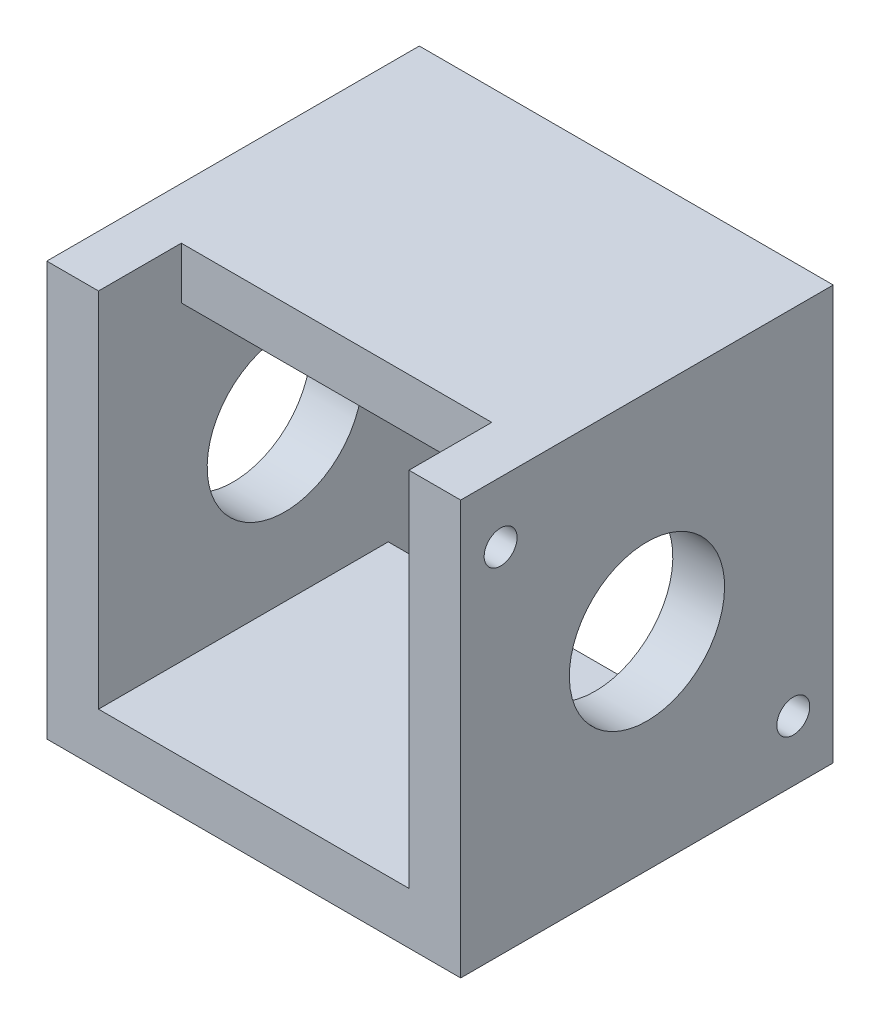
ISO-10303-21;
HEADER;
FILE_DESCRIPTION(('STEP AP214'),'2;1');
FILE_NAME('part.step','',(''),(''),'','','');
FILE_SCHEMA(('AUTOMOTIVE_DESIGN { 1 0 10303 214 1 1 1 1 }'));
ENDSEC;
DATA;
#1=APPLICATION_CONTEXT('core data for automotive mechanical design processes');
#2=APPLICATION_PROTOCOL_DEFINITION('international standard','automotive_design',2000,#1);
#3=PRODUCT_CONTEXT('',#1,'mechanical');
#4=PRODUCT('Part','Part','',(#3));
#5=PRODUCT_RELATED_PRODUCT_CATEGORY('part','',(#4));
#6=PRODUCT_DEFINITION_FORMATION('','',#4);
#7=PRODUCT_DEFINITION_CONTEXT('part definition',#1,'design');
#8=PRODUCT_DEFINITION('design','',#6,#7);
#9=PRODUCT_DEFINITION_SHAPE('','',#8);
#10=(LENGTH_UNIT() NAMED_UNIT(*) SI_UNIT(.MILLI.,.METRE.));
#11=(NAMED_UNIT(*) PLANE_ANGLE_UNIT() SI_UNIT($,.RADIAN.));
#12=(NAMED_UNIT(*) SI_UNIT($,.STERADIAN.) SOLID_ANGLE_UNIT());
#13=UNCERTAINTY_MEASURE_WITH_UNIT(LENGTH_MEASURE(1.E-05),#10,'distance_accuracy_value','');
#14=(GEOMETRIC_REPRESENTATION_CONTEXT(3) GLOBAL_UNCERTAINTY_ASSIGNED_CONTEXT((#13)) GLOBAL_UNIT_ASSIGNED_CONTEXT((#10,
#11,#12)) REPRESENTATION_CONTEXT('',''));
#15=CARTESIAN_POINT('',(0.,0.,0.));
#16=DIRECTION('',(0.,0.,1.));
#17=DIRECTION('',(1.,0.,0.));
#18=AXIS2_PLACEMENT_3D('',#15,#16,#17);
#19=CARTESIAN_POINT('',(0.,0.,45.72));
#20=DIRECTION('',(0.,0.,1.));
#21=DIRECTION('',(1.,0.,0.));
#22=AXIS2_PLACEMENT_3D('',#19,#20,#21);
#23=PLANE('',#22);
#24=DIRECTION('',(-1.,0.,0.));
#25=VECTOR('',#24,1.);
#26=CARTESIAN_POINT('',(-25.4,25.4,45.72));
#27=LINE('',#26,#25);
#28=CARTESIAN_POINT('',(25.4,25.4,45.72));
#29=VERTEX_POINT('',#28);
#30=CARTESIAN_POINT('',(19.05,25.4,45.72));
#31=VERTEX_POINT('',#30);
#32=EDGE_CURVE('E121',#29,#31,#27,.T.);
#33=ORIENTED_EDGE('',*,*,#32,.T.);
#34=DIRECTION('',(0.,1.,0.));
#35=VECTOR('',#34,1.);
#36=CARTESIAN_POINT('',(19.05,25.4,45.72));
#37=LINE('',#36,#35);
#38=CARTESIAN_POINT('',(19.05,-19.05,45.72));
#39=VERTEX_POINT('',#38);
#40=EDGE_CURVE('E169',#39,#31,#37,.T.);
#41=ORIENTED_EDGE('',*,*,#40,.F.);
#42=DIRECTION('',(1.,0.,0.));
#43=VECTOR('',#42,1.);
#44=CARTESIAN_POINT('',(-25.4,-19.05,45.72));
#45=LINE('',#44,#43);
#46=CARTESIAN_POINT('',(-19.05,-19.05,45.72));
#47=VERTEX_POINT('',#46);
#48=EDGE_CURVE('E258',#47,#39,#45,.T.);
#49=ORIENTED_EDGE('',*,*,#48,.F.);
#50=DIRECTION('',(0.,-1.,0.));
#51=VECTOR('',#50,1.);
#52=CARTESIAN_POINT('',(-19.05,25.4,45.72));
#53=LINE('',#52,#51);
#54=CARTESIAN_POINT('',(-19.05,25.4,45.72));
#55=VERTEX_POINT('',#54);
#56=EDGE_CURVE('E84',#55,#47,#53,.T.);
#57=ORIENTED_EDGE('',*,*,#56,.F.);
#58=CARTESIAN_POINT('',(-25.4,25.4,45.72));
#59=VERTEX_POINT('',#58);
#60=EDGE_CURVE('E194',#55,#59,#27,.T.);
#61=ORIENTED_EDGE('',*,*,#60,.T.);
#62=DIRECTION('',(0.,-1.,0.));
#63=VECTOR('',#62,1.);
#64=CARTESIAN_POINT('',(-25.4,25.4,45.72));
#65=LINE('',#64,#63);
#66=CARTESIAN_POINT('',(-25.4,-25.4,45.72));
#67=VERTEX_POINT('',#66);
#68=EDGE_CURVE('E193',#59,#67,#65,.T.);
#69=ORIENTED_EDGE('',*,*,#68,.T.);
#70=DIRECTION('',(1.,0.,0.));
#71=VECTOR('',#70,1.);
#72=CARTESIAN_POINT('',(-25.4,-25.4,45.72));
#73=LINE('',#72,#71);
#74=CARTESIAN_POINT('',(25.4,-25.4,45.72));
#75=VERTEX_POINT('',#74);
#76=EDGE_CURVE('E93',#67,#75,#73,.T.);
#77=ORIENTED_EDGE('',*,*,#76,.T.);
#78=DIRECTION('',(0.,1.,0.));
#79=VECTOR('',#78,1.);
#80=CARTESIAN_POINT('',(25.4,25.4,45.72));
#81=LINE('',#80,#79);
#82=EDGE_CURVE('E190',#75,#29,#81,.T.);
#83=ORIENTED_EDGE('',*,*,#82,.T.);
#84=EDGE_LOOP('',(#33,#41,#49,#57,#61,#69,#77,#83));
#85=FACE_BOUND('',#84,.T.);
#86=ADVANCED_FACE('F67',(#85),#23,.T.);
#87=CARTESIAN_POINT('',(-25.4,25.4,45.72));
#88=DIRECTION('',(0.,-1.,0.));
#89=DIRECTION('',(0.,0.,-1.));
#90=AXIS2_PLACEMENT_3D('',#87,#88,#89);
#91=PLANE('',#90);
#92=DIRECTION('',(0.,0.,1.));
#93=VECTOR('',#92,1.);
#94=CARTESIAN_POINT('',(19.05,25.4,0.));
#95=LINE('',#94,#93);
#96=CARTESIAN_POINT('',(19.05,25.4,35.56));
#97=VERTEX_POINT('',#96);
#98=EDGE_CURVE('E173',#97,#31,#95,.T.);
#99=ORIENTED_EDGE('',*,*,#98,.T.);
#100=ORIENTED_EDGE('',*,*,#32,.F.);
#101=DIRECTION('',(0.,0.,-1.));
#102=VECTOR('',#101,1.);
#103=CARTESIAN_POINT('',(25.4,25.4,45.72));
#104=LINE('',#103,#102);
#105=CARTESIAN_POINT('',(25.4,25.4,0.));
#106=VERTEX_POINT('',#105);
#107=EDGE_CURVE('E12',#29,#106,#104,.T.);
#108=ORIENTED_EDGE('',*,*,#107,.T.);
#109=DIRECTION('',(-1.,0.,0.));
#110=VECTOR('',#109,1.);
#111=CARTESIAN_POINT('',(-25.4,25.4,0.));
#112=LINE('',#111,#110);
#113=CARTESIAN_POINT('',(-25.4,25.4,0.));
#114=VERTEX_POINT('',#113);
#115=EDGE_CURVE('E209',#106,#114,#112,.T.);
#116=ORIENTED_EDGE('',*,*,#115,.T.);
#117=DIRECTION('',(0.,0.,-1.));
#118=VECTOR('',#117,1.);
#119=CARTESIAN_POINT('',(-25.4,25.4,45.72));
#120=LINE('',#119,#118);
#121=EDGE_CURVE('E77',#59,#114,#120,.T.);
#122=ORIENTED_EDGE('',*,*,#121,.F.);
#123=ORIENTED_EDGE('',*,*,#60,.F.);
#124=DIRECTION('',(0.,0.,1.));
#125=VECTOR('',#124,1.);
#126=CARTESIAN_POINT('',(-19.05,25.4,0.));
#127=LINE('',#126,#125);
#128=CARTESIAN_POINT('',(-19.05,25.4,35.56));
#129=VERTEX_POINT('',#128);
#130=EDGE_CURVE('E186',#129,#55,#127,.T.);
#131=ORIENTED_EDGE('',*,*,#130,.F.);
#132=DIRECTION('',(1.,0.,0.));
#133=VECTOR('',#132,1.);
#134=CARTESIAN_POINT('',(0.,25.4,35.56));
#135=LINE('',#134,#133);
#136=EDGE_CURVE('E184',#129,#97,#135,.T.);
#137=ORIENTED_EDGE('',*,*,#136,.T.);
#138=EDGE_LOOP('',(#99,#100,#108,#116,#122,#123,#131,#137));
#139=FACE_BOUND('',#138,.T.);
#140=ADVANCED_FACE('F182',(#139),#91,.F.);
#141=CARTESIAN_POINT('',(-25.4,19.05,45.72));
#142=DIRECTION('',(0.,-1.,0.));
#143=DIRECTION('',(0.,0.,-1.));
#144=AXIS2_PLACEMENT_3D('',#141,#142,#143);
#145=PLANE('',#144);
#146=DIRECTION('',(0.,0.,-1.));
#147=VECTOR('',#146,1.);
#148=CARTESIAN_POINT('',(19.05,19.05,45.72));
#149=LINE('',#148,#147);
#150=CARTESIAN_POINT('',(19.05,19.05,35.56));
#151=VERTEX_POINT('',#150);
#152=CARTESIAN_POINT('',(19.05,19.05,0.));
#153=VERTEX_POINT('',#152);
#154=EDGE_CURVE('E210',#151,#153,#149,.T.);
#155=ORIENTED_EDGE('',*,*,#154,.F.);
#156=DIRECTION('',(-1.,0.,0.));
#157=VECTOR('',#156,1.);
#158=CARTESIAN_POINT('',(-25.4,19.05,35.56));
#159=LINE('',#158,#157);
#160=CARTESIAN_POINT('',(-19.05,19.05,35.56));
#161=VERTEX_POINT('',#160);
#162=EDGE_CURVE('E320',#151,#161,#159,.T.);
#163=ORIENTED_EDGE('',*,*,#162,.T.);
#164=DIRECTION('',(0.,0.,-1.));
#165=VECTOR('',#164,1.);
#166=CARTESIAN_POINT('',(-19.05,19.05,45.72));
#167=LINE('',#166,#165);
#168=CARTESIAN_POINT('',(-19.05,19.05,0.));
#169=VERTEX_POINT('',#168);
#170=EDGE_CURVE('E251',#161,#169,#167,.T.);
#171=ORIENTED_EDGE('',*,*,#170,.T.);
#172=DIRECTION('',(-1.,0.,0.));
#173=VECTOR('',#172,1.);
#174=CARTESIAN_POINT('',(-25.4,19.05,0.));
#175=LINE('',#174,#173);
#176=EDGE_CURVE('E265',#153,#169,#175,.T.);
#177=ORIENTED_EDGE('',*,*,#176,.F.);
#178=EDGE_LOOP('',(#155,#163,#171,#177));
#179=FACE_BOUND('',#178,.T.);
#180=ADVANCED_FACE('F337',(#179),#145,.T.);
#181=CARTESIAN_POINT('',(-25.4,-19.05,45.72));
#182=DIRECTION('',(0.,1.,0.));
#183=DIRECTION('',(0.,0.,1.));
#184=AXIS2_PLACEMENT_3D('',#181,#182,#183);
#185=PLANE('',#184);
#186=DIRECTION('',(0.,0.,-1.));
#187=VECTOR('',#186,1.);
#188=CARTESIAN_POINT('',(19.05,-19.05,45.72));
#189=LINE('',#188,#187);
#190=CARTESIAN_POINT('',(19.05,-19.05,10.16));
#191=VERTEX_POINT('',#190);
#192=EDGE_CURVE('E176',#39,#191,#189,.T.);
#193=ORIENTED_EDGE('',*,*,#192,.T.);
#194=DIRECTION('',(-1.,0.,0.));
#195=VECTOR('',#194,1.);
#196=CARTESIAN_POINT('',(0.,-19.05,10.16));
#197=LINE('',#196,#195);
#198=CARTESIAN_POINT('',(-19.05,-19.05,10.16));
#199=VERTEX_POINT('',#198);
#200=EDGE_CURVE('E316',#191,#199,#197,.T.);
#201=ORIENTED_EDGE('',*,*,#200,.T.);
#202=DIRECTION('',(0.,0.,-1.));
#203=VECTOR('',#202,1.);
#204=CARTESIAN_POINT('',(-19.05,-19.05,45.72));
#205=LINE('',#204,#203);
#206=EDGE_CURVE('E253',#47,#199,#205,.T.);
#207=ORIENTED_EDGE('',*,*,#206,.F.);
#208=ORIENTED_EDGE('',*,*,#48,.T.);
#209=EDGE_LOOP('',(#193,#201,#207,#208));
#210=FACE_BOUND('',#209,.T.);
#211=ADVANCED_FACE('F347',(#210),#185,.T.);
#212=CARTESIAN_POINT('',(0.,0.,0.));
#213=DIRECTION('',(0.,0.,1.));
#214=DIRECTION('',(1.,0.,0.));
#215=AXIS2_PLACEMENT_3D('',#212,#213,#214);
#216=PLANE('',#215);
#217=DIRECTION('',(0.,-1.,0.));
#218=VECTOR('',#217,1.);
#219=CARTESIAN_POINT('',(-19.05,25.4,0.));
#220=LINE('',#219,#218);
#221=CARTESIAN_POINT('',(-19.05,-25.4,0.));
#222=VERTEX_POINT('',#221);
#223=EDGE_CURVE('E179',#169,#222,#220,.T.);
#224=ORIENTED_EDGE('',*,*,#223,.T.);
#225=DIRECTION('',(1.,0.,0.));
#226=VECTOR('',#225,1.);
#227=CARTESIAN_POINT('',(-25.4,-25.4,0.));
#228=LINE('',#227,#226);
#229=CARTESIAN_POINT('',(-25.4,-25.4,0.));
#230=VERTEX_POINT('',#229);
#231=EDGE_CURVE('E216',#230,#222,#228,.T.);
#232=ORIENTED_EDGE('',*,*,#231,.F.);
#233=DIRECTION('',(0.,-1.,0.));
#234=VECTOR('',#233,1.);
#235=CARTESIAN_POINT('',(-25.4,25.4,0.));
#236=LINE('',#235,#234);
#237=EDGE_CURVE('E213',#114,#230,#236,.T.);
#238=ORIENTED_EDGE('',*,*,#237,.F.);
#239=ORIENTED_EDGE('',*,*,#115,.F.);
#240=DIRECTION('',(0.,1.,0.));
#241=VECTOR('',#240,1.);
#242=CARTESIAN_POINT('',(25.4,25.4,0.));
#243=LINE('',#242,#241);
#244=CARTESIAN_POINT('',(25.4,-25.4,0.));
#245=VERTEX_POINT('',#244);
#246=EDGE_CURVE('E205',#245,#106,#243,.T.);
#247=ORIENTED_EDGE('',*,*,#246,.F.);
#248=CARTESIAN_POINT('',(19.05,-25.4,0.));
#249=VERTEX_POINT('',#248);
#250=EDGE_CURVE('E114',#249,#245,#228,.T.);
#251=ORIENTED_EDGE('',*,*,#250,.F.);
#252=DIRECTION('',(0.,1.,0.));
#253=VECTOR('',#252,1.);
#254=CARTESIAN_POINT('',(19.05,25.4,0.));
#255=LINE('',#254,#253);
#256=EDGE_CURVE('E268',#249,#153,#255,.T.);
#257=ORIENTED_EDGE('',*,*,#256,.T.);
#258=ORIENTED_EDGE('',*,*,#176,.T.);
#259=EDGE_LOOP('',(#224,#232,#238,#239,#247,#251,#257,#258));
#260=FACE_BOUND('',#259,.T.);
#261=ADVANCED_FACE('F237',(#260),#216,.F.);
#262=CARTESIAN_POINT('',(25.4,25.4,45.72));
#263=DIRECTION('',(-1.,0.,0.));
#264=DIRECTION('',(0.,-1.,0.));
#265=AXIS2_PLACEMENT_3D('',#262,#263,#264);
#266=PLANE('',#265);
#267=CARTESIAN_POINT('',(25.4,0.,22.86));
#268=DIRECTION('',(-1.,0.,0.));
#269=DIRECTION('',(0.,-1.,0.));
#270=AXIS2_PLACEMENT_3D('',#267,#268,#269);
#271=CIRCLE('',#270,9.525);
#272=CARTESIAN_POINT('',(25.4,-9.525,22.86));
#273=VERTEX_POINT('',#272);
#274=EDGE_CURVE('E288',#273,#273,#271,.T.);
#275=ORIENTED_EDGE('',*,*,#274,.T.);
#276=EDGE_LOOP('',(#275));
#277=FACE_BOUND('',#276,.T.);
#278=CARTESIAN_POINT('',(25.4,17.96051224,40.820512212));
#279=DIRECTION('',(-1.,0.,0.));
#280=DIRECTION('',(0.,-1.,0.));
#281=AXIS2_PLACEMENT_3D('',#278,#279,#280);
#282=CIRCLE('',#281,2.01929999999999);
#283=CARTESIAN_POINT('',(25.4,15.94121224,40.820512212));
#284=VERTEX_POINT('',#283);
#285=EDGE_CURVE('E272',#284,#284,#282,.T.);
#286=ORIENTED_EDGE('',*,*,#285,.T.);
#287=EDGE_LOOP('',(#286));
#288=FACE_BOUND('',#287,.T.);
#289=CARTESIAN_POINT('',(25.4,-17.96051224,4.899487788));
#290=DIRECTION('',(-1.,0.,0.));
#291=DIRECTION('',(0.,-1.,0.));
#292=AXIS2_PLACEMENT_3D('',#289,#290,#291);
#293=CIRCLE('',#292,2.0193);
#294=CARTESIAN_POINT('',(25.4,-19.97981224,4.899487788));
#295=VERTEX_POINT('',#294);
#296=EDGE_CURVE('E276',#295,#295,#293,.T.);
#297=ORIENTED_EDGE('',*,*,#296,.T.);
#298=EDGE_LOOP('',(#297));
#299=FACE_BOUND('',#298,.T.);
#300=ORIENTED_EDGE('',*,*,#246,.T.);
#301=ORIENTED_EDGE('',*,*,#107,.F.);
#302=ORIENTED_EDGE('',*,*,#82,.F.);
#303=DIRECTION('',(0.,0.,-1.));
#304=VECTOR('',#303,1.);
#305=CARTESIAN_POINT('',(25.4,-25.4,45.72));
#306=LINE('',#305,#304);
#307=EDGE_CURVE('E204',#75,#245,#306,.T.);
#308=ORIENTED_EDGE('',*,*,#307,.T.);
#309=EDGE_LOOP('',(#300,#301,#302,#308));
#310=FACE_BOUND('',#309,.T.);
#311=ADVANCED_FACE('F69',(#277,#288,#299,#310),#266,.F.);
#312=CARTESIAN_POINT('',(-25.4,25.4,45.72));
#313=DIRECTION('',(1.,0.,0.));
#314=DIRECTION('',(0.,1.,0.));
#315=AXIS2_PLACEMENT_3D('',#312,#313,#314);
#316=PLANE('',#315);
#317=CARTESIAN_POINT('',(-25.4,0.,22.86));
#318=DIRECTION('',(1.,0.,0.));
#319=DIRECTION('',(0.,1.,0.));
#320=AXIS2_PLACEMENT_3D('',#317,#318,#319);
#321=CIRCLE('',#320,9.525);
#322=CARTESIAN_POINT('',(-25.4,9.525,22.86));
#323=VERTEX_POINT('',#322);
#324=EDGE_CURVE('E299',#323,#323,#321,.T.);
#325=ORIENTED_EDGE('',*,*,#324,.T.);
#326=EDGE_LOOP('',(#325));
#327=FACE_BOUND('',#326,.T.);
#328=ORIENTED_EDGE('',*,*,#237,.T.);
#329=DIRECTION('',(0.,0.,-1.));
#330=VECTOR('',#329,1.);
#331=CARTESIAN_POINT('',(-25.4,-25.4,45.72));
#332=LINE('',#331,#330);
#333=EDGE_CURVE('E222',#67,#230,#332,.T.);
#334=ORIENTED_EDGE('',*,*,#333,.F.);
#335=ORIENTED_EDGE('',*,*,#68,.F.);
#336=ORIENTED_EDGE('',*,*,#121,.T.);
#337=EDGE_LOOP('',(#328,#334,#335,#336));
#338=FACE_BOUND('',#337,.T.);
#339=ADVANCED_FACE('F232',(#327,#338),#316,.F.);
#340=CARTESIAN_POINT('',(-25.4,-25.4,45.72));
#341=DIRECTION('',(0.,1.,0.));
#342=DIRECTION('',(0.,0.,1.));
#343=AXIS2_PLACEMENT_3D('',#340,#341,#342);
#344=PLANE('',#343);
#345=ORIENTED_EDGE('',*,*,#231,.T.);
#346=DIRECTION('',(0.,0.,1.));
#347=VECTOR('',#346,1.);
#348=CARTESIAN_POINT('',(-19.05,-25.4,45.72));
#349=LINE('',#348,#347);
#350=CARTESIAN_POINT('',(-19.05,-25.4,10.16));
#351=VERTEX_POINT('',#350);
#352=EDGE_CURVE('E245',#222,#351,#349,.T.);
#353=ORIENTED_EDGE('',*,*,#352,.T.);
#354=DIRECTION('',(-1.,0.,0.));
#355=VECTOR('',#354,1.);
#356=CARTESIAN_POINT('',(-25.4,-25.4,10.16));
#357=LINE('',#356,#355);
#358=CARTESIAN_POINT('',(19.05,-25.4,10.16));
#359=VERTEX_POINT('',#358);
#360=EDGE_CURVE('E304',#359,#351,#357,.T.);
#361=ORIENTED_EDGE('',*,*,#360,.F.);
#362=DIRECTION('',(0.,0.,1.));
#363=VECTOR('',#362,1.);
#364=CARTESIAN_POINT('',(19.05,-25.4,45.72));
#365=LINE('',#364,#363);
#366=EDGE_CURVE('E307',#249,#359,#365,.T.);
#367=ORIENTED_EDGE('',*,*,#366,.F.);
#368=ORIENTED_EDGE('',*,*,#250,.T.);
#369=ORIENTED_EDGE('',*,*,#307,.F.);
#370=ORIENTED_EDGE('',*,*,#76,.F.);
#371=ORIENTED_EDGE('',*,*,#333,.T.);
#372=EDGE_LOOP('',(#345,#353,#361,#367,#368,#369,#370,#371));
#373=FACE_BOUND('',#372,.T.);
#374=ADVANCED_FACE('F243',(#373),#344,.F.);
#375=CARTESIAN_POINT('',(19.05,25.4,45.72));
#376=DIRECTION('',(-1.,0.,0.));
#377=DIRECTION('',(0.,-1.,0.));
#378=AXIS2_PLACEMENT_3D('',#375,#376,#377);
#379=PLANE('',#378);
#380=ORIENTED_EDGE('',*,*,#40,.T.);
#381=ORIENTED_EDGE('',*,*,#98,.F.);
#382=DIRECTION('',(0.,-1.,0.));
#383=VECTOR('',#382,1.);
#384=CARTESIAN_POINT('',(19.05,64.8314037285005,35.56));
#385=LINE('',#384,#383);
#386=EDGE_CURVE('E330',#97,#151,#385,.T.);
#387=ORIENTED_EDGE('',*,*,#386,.T.);
#388=ORIENTED_EDGE('',*,*,#154,.T.);
#389=ORIENTED_EDGE('',*,*,#256,.F.);
#390=ORIENTED_EDGE('',*,*,#366,.T.);
#391=DIRECTION('',(0.,1.,0.));
#392=VECTOR('',#391,1.);
#393=CARTESIAN_POINT('',(19.05,-25.400012,10.16));
#394=LINE('',#393,#392);
#395=EDGE_CURVE('E310',#359,#191,#394,.T.);
#396=ORIENTED_EDGE('',*,*,#395,.T.);
#397=ORIENTED_EDGE('',*,*,#192,.F.);
#398=EDGE_LOOP('',(#380,#381,#387,#388,#389,#390,#396,#397));
#399=FACE_BOUND('',#398,.T.);
#400=CARTESIAN_POINT('',(19.05,0.,22.86));
#401=DIRECTION('',(-1.,0.,0.));
#402=DIRECTION('',(0.,-1.,0.));
#403=AXIS2_PLACEMENT_3D('',#400,#401,#402);
#404=CIRCLE('',#403,9.525);
#405=CARTESIAN_POINT('',(19.05,-9.525,22.86));
#406=VERTEX_POINT('',#405);
#407=EDGE_CURVE('E292',#406,#406,#404,.T.);
#408=ORIENTED_EDGE('',*,*,#407,.F.);
#409=EDGE_LOOP('',(#408));
#410=FACE_BOUND('',#409,.T.);
#411=CARTESIAN_POINT('',(19.05,-17.96051224,4.899487788));
#412=DIRECTION('',(-1.,0.,0.));
#413=DIRECTION('',(0.,-1.,0.));
#414=AXIS2_PLACEMENT_3D('',#411,#412,#413);
#415=CIRCLE('',#414,2.0193);
#416=CARTESIAN_POINT('',(19.05,-19.97981224,4.899487788));
#417=VERTEX_POINT('',#416);
#418=EDGE_CURVE('E284',#417,#417,#415,.F.);
#419=ORIENTED_EDGE('',*,*,#418,.T.);
#420=EDGE_LOOP('',(#419));
#421=FACE_BOUND('',#420,.T.);
#422=CARTESIAN_POINT('',(19.05,17.96051224,40.820512212));
#423=DIRECTION('',(-1.,0.,0.));
#424=DIRECTION('',(0.,-1.,0.));
#425=AXIS2_PLACEMENT_3D('',#422,#423,#424);
#426=CIRCLE('',#425,2.01929999999999);
#427=CARTESIAN_POINT('',(19.05,15.94121224,40.820512212));
#428=VERTEX_POINT('',#427);
#429=EDGE_CURVE('E280',#428,#428,#426,.F.);
#430=ORIENTED_EDGE('',*,*,#429,.T.);
#431=EDGE_LOOP('',(#430));
#432=FACE_BOUND('',#431,.T.);
#433=ADVANCED_FACE('F170',(#399,#410,#421,#432),#379,.T.);
#434=CARTESIAN_POINT('',(-19.05,25.4,45.72));
#435=DIRECTION('',(1.,0.,0.));
#436=DIRECTION('',(0.,1.,0.));
#437=AXIS2_PLACEMENT_3D('',#434,#435,#436);
#438=PLANE('',#437);
#439=ORIENTED_EDGE('',*,*,#56,.T.);
#440=ORIENTED_EDGE('',*,*,#206,.T.);
#441=DIRECTION('',(0.,1.,0.));
#442=VECTOR('',#441,1.);
#443=CARTESIAN_POINT('',(-19.05,-25.400012,10.16));
#444=LINE('',#443,#442);
#445=EDGE_CURVE('E313',#351,#199,#444,.T.);
#446=ORIENTED_EDGE('',*,*,#445,.F.);
#447=ORIENTED_EDGE('',*,*,#352,.F.);
#448=ORIENTED_EDGE('',*,*,#223,.F.);
#449=ORIENTED_EDGE('',*,*,#170,.F.);
#450=DIRECTION('',(0.,-1.,0.));
#451=VECTOR('',#450,1.);
#452=CARTESIAN_POINT('',(-19.05,64.8314037285005,35.56));
#453=LINE('',#452,#451);
#454=EDGE_CURVE('E187',#129,#161,#453,.T.);
#455=ORIENTED_EDGE('',*,*,#454,.F.);
#456=ORIENTED_EDGE('',*,*,#130,.T.);
#457=EDGE_LOOP('',(#439,#440,#446,#447,#448,#449,#455,#456));
#458=FACE_BOUND('',#457,.T.);
#459=CARTESIAN_POINT('',(-19.05,0.,22.86));
#460=DIRECTION('',(1.,0.,0.));
#461=DIRECTION('',(0.,1.,0.));
#462=AXIS2_PLACEMENT_3D('',#459,#460,#461);
#463=CIRCLE('',#462,9.525);
#464=CARTESIAN_POINT('',(-19.05,9.525,22.86));
#465=VERTEX_POINT('',#464);
#466=EDGE_CURVE('E71',#465,#465,#463,.T.);
#467=ORIENTED_EDGE('',*,*,#466,.F.);
#468=EDGE_LOOP('',(#467));
#469=FACE_BOUND('',#468,.T.);
#470=ADVANCED_FACE('F344',(#458,#469),#438,.T.);
#471=CARTESIAN_POINT('',(13.338557107,-17.96051224,4.899487788));
#472=DIRECTION('',(1.,0.,0.));
#473=DIRECTION('',(0.,1.,0.));
#474=AXIS2_PLACEMENT_3D('',#471,#472,#473);
#475=CYLINDRICAL_SURFACE('',#474,2.0193);
#476=ORIENTED_EDGE('',*,*,#418,.F.);
#477=EDGE_LOOP('',(#476));
#478=FACE_BOUND('',#477,.T.);
#479=ORIENTED_EDGE('',*,*,#296,.F.);
#480=EDGE_LOOP('',(#479));
#481=FACE_BOUND('',#480,.T.);
#482=ADVANCED_FACE('F387',(#478,#481),#475,.F.);
#483=CARTESIAN_POINT('',(13.338557107,17.96051224,40.820512212));
#484=DIRECTION('',(1.,0.,0.));
#485=DIRECTION('',(0.,1.,0.));
#486=AXIS2_PLACEMENT_3D('',#483,#484,#485);
#487=CYLINDRICAL_SURFACE('',#486,2.01929999999999);
#488=ORIENTED_EDGE('',*,*,#429,.F.);
#489=EDGE_LOOP('',(#488));
#490=FACE_BOUND('',#489,.T.);
#491=ORIENTED_EDGE('',*,*,#285,.F.);
#492=EDGE_LOOP('',(#491));
#493=FACE_BOUND('',#492,.T.);
#494=ADVANCED_FACE('F379',(#490,#493),#487,.F.);
#495=CARTESIAN_POINT('',(-25.4,0.,22.86));
#496=DIRECTION('',(1.,0.,0.));
#497=DIRECTION('',(0.,1.,0.));
#498=AXIS2_PLACEMENT_3D('',#495,#496,#497);
#499=CYLINDRICAL_SURFACE('',#498,9.525);
#500=ORIENTED_EDGE('',*,*,#466,.T.);
#501=EDGE_LOOP('',(#500));
#502=FACE_BOUND('',#501,.T.);
#503=ORIENTED_EDGE('',*,*,#324,.F.);
#504=EDGE_LOOP('',(#503));
#505=FACE_BOUND('',#504,.T.);
#506=ADVANCED_FACE('F377',(#502,#505),#499,.F.);
#507=ORIENTED_EDGE('',*,*,#407,.T.);
#508=EDGE_LOOP('',(#507));
#509=FACE_BOUND('',#508,.T.);
#510=ORIENTED_EDGE('',*,*,#274,.F.);
#511=EDGE_LOOP('',(#510));
#512=FACE_BOUND('',#511,.T.);
#513=ADVANCED_FACE('F355',(#509,#512),#499,.F.);
#514=CARTESIAN_POINT('',(0.,-25.400012,10.16));
#515=DIRECTION('',(0.,0.,-1.));
#516=DIRECTION('',(-1.,0.,0.));
#517=AXIS2_PLACEMENT_3D('',#514,#515,#516);
#518=PLANE('',#517);
#519=ORIENTED_EDGE('',*,*,#360,.T.);
#520=ORIENTED_EDGE('',*,*,#445,.T.);
#521=ORIENTED_EDGE('',*,*,#200,.F.);
#522=ORIENTED_EDGE('',*,*,#395,.F.);
#523=EDGE_LOOP('',(#519,#520,#521,#522));
#524=FACE_BOUND('',#523,.T.);
#525=ADVANCED_FACE('F342',(#524),#518,.T.);
#526=CARTESIAN_POINT('',(0.,64.8314037285005,35.56));
#527=DIRECTION('',(0.,0.,1.));
#528=DIRECTION('',(1.,0.,0.));
#529=AXIS2_PLACEMENT_3D('',#526,#527,#528);
#530=PLANE('',#529);
#531=ORIENTED_EDGE('',*,*,#386,.F.);
#532=ORIENTED_EDGE('',*,*,#136,.F.);
#533=ORIENTED_EDGE('',*,*,#454,.T.);
#534=ORIENTED_EDGE('',*,*,#162,.F.);
#535=EDGE_LOOP('',(#531,#532,#533,#534));
#536=FACE_BOUND('',#535,.T.);
#537=ADVANCED_FACE('F349',(#536),#530,.T.);
#538=CLOSED_SHELL('',(#86,#140,#180,#211,#261,#311,#339,#374,#433,#470,#482,#494,#506,#513,#525,#537));
#539=MANIFOLD_SOLID_BREP('B2',#538);
#540=ADVANCED_BREP_SHAPE_REPRESENTATION('',(#18,#539),#14);
#541=SHAPE_DEFINITION_REPRESENTATION(#9,#540);
ENDSEC;
END-ISO-10303-21;
